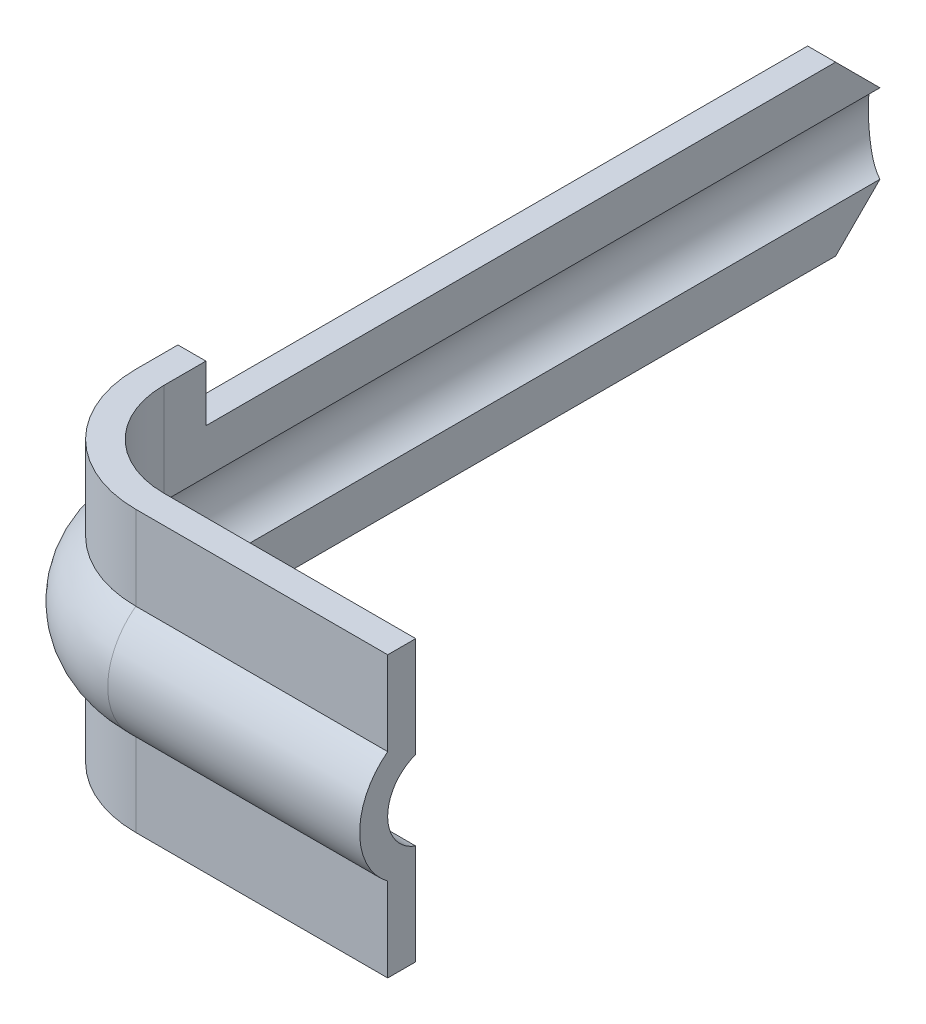
ISO-10303-21;
HEADER;
FILE_DESCRIPTION(('STEP AP214'),'2;1');
FILE_NAME('part.step','',(''),(''),'','','');
FILE_SCHEMA(('AUTOMOTIVE_DESIGN { 1 0 10303 214 1 1 1 1 }'));
ENDSEC;
DATA;
#1=APPLICATION_CONTEXT('core data for automotive mechanical design processes');
#2=APPLICATION_PROTOCOL_DEFINITION('international standard','automotive_design',2000,#1);
#3=PRODUCT_CONTEXT('',#1,'mechanical');
#4=PRODUCT('Part','Part','',(#3));
#5=PRODUCT_RELATED_PRODUCT_CATEGORY('part','',(#4));
#6=PRODUCT_DEFINITION_FORMATION('','',#4);
#7=PRODUCT_DEFINITION_CONTEXT('part definition',#1,'design');
#8=PRODUCT_DEFINITION('design','',#6,#7);
#9=PRODUCT_DEFINITION_SHAPE('','',#8);
#10=(LENGTH_UNIT() NAMED_UNIT(*) SI_UNIT(.MILLI.,.METRE.));
#11=(NAMED_UNIT(*) PLANE_ANGLE_UNIT() SI_UNIT($,.RADIAN.));
#12=(NAMED_UNIT(*) SI_UNIT($,.STERADIAN.) SOLID_ANGLE_UNIT());
#13=UNCERTAINTY_MEASURE_WITH_UNIT(LENGTH_MEASURE(1.E-05),#10,'distance_accuracy_value','');
#14=(GEOMETRIC_REPRESENTATION_CONTEXT(3) GLOBAL_UNCERTAINTY_ASSIGNED_CONTEXT((#13)) GLOBAL_UNIT_ASSIGNED_CONTEXT((#10,
#11,#12)) REPRESENTATION_CONTEXT('',''));
#15=CARTESIAN_POINT('',(0.,0.,0.));
#16=DIRECTION('',(0.,0.,1.));
#17=DIRECTION('',(1.,0.,0.));
#18=AXIS2_PLACEMENT_3D('',#15,#16,#17);
#19=CARTESIAN_POINT('',(0.65,0.,4.475485135615));
#20=DIRECTION('',(1.,0.,0.));
#21=DIRECTION('',(0.,0.,-1.));
#22=AXIS2_PLACEMENT_3D('',#19,#20,#21);
#23=CYLINDRICAL_SURFACE('',#22,0.375);
#24=DIRECTION('',(1.,0.,0.));
#25=VECTOR('',#24,1.);
#26=CARTESIAN_POINT('',(0.65,-0.300363239545,4.7));
#27=LINE('',#26,#25);
#28=CARTESIAN_POINT('',(2.,-0.300363239545206,4.7));
#29=VERTEX_POINT('',#28);
#30=CARTESIAN_POINT('',(0.65,-0.300363239545066,4.70000000000005));
#31=VERTEX_POINT('',#30);
#32=EDGE_CURVE('E157',#29,#31,#27,.F.);
#33=ORIENTED_EDGE('',*,*,#32,.F.);
#34=CARTESIAN_POINT('',(2.,0.,4.475485135615));
#35=DIRECTION('',(1.,0.,0.));
#36=DIRECTION('',(0.,0.,-1.));
#37=AXIS2_PLACEMENT_3D('',#34,#35,#36);
#38=CIRCLE('',#37,0.375);
#39=CARTESIAN_POINT('',(2.,0.300363239545158,4.7));
#40=VERTEX_POINT('',#39);
#41=EDGE_CURVE('E21',#29,#40,#38,.F.);
#42=ORIENTED_EDGE('',*,*,#41,.T.);
#43=DIRECTION('',(1.,0.,0.));
#44=VECTOR('',#43,1.);
#45=CARTESIAN_POINT('',(0.65,0.300363239545,4.7));
#46=LINE('',#45,#44);
#47=CARTESIAN_POINT('',(0.65,0.300363239545051,4.70000000000004));
#48=VERTEX_POINT('',#47);
#49=EDGE_CURVE('E154',#48,#40,#46,.T.);
#50=ORIENTED_EDGE('',*,*,#49,.F.);
#51=CARTESIAN_POINT('',(0.65,0.,4.475485135615));
#52=DIRECTION('',(1.,0.,0.));
#53=DIRECTION('',(0.,0.,-1.));
#54=AXIS2_PLACEMENT_3D('',#51,#52,#53);
#55=CIRCLE('',#54,0.375);
#56=EDGE_CURVE('E130',#48,#31,#55,.T.);
#57=ORIENTED_EDGE('',*,*,#56,.T.);
#58=EDGE_LOOP('',(#33,#42,#50,#57));
#59=FACE_BOUND('',#58,.T.);
#60=ADVANCED_FACE('F17',(#59),#23,.T.);
#61=CARTESIAN_POINT('',(0.65,0.,4.475485135615));
#62=DIRECTION('',(1.,0.,0.));
#63=DIRECTION('',(0.,0.,-1.));
#64=AXIS2_PLACEMENT_3D('',#61,#62,#63);
#65=CYLINDRICAL_SURFACE('',#64,0.225);
#66=DIRECTION('',(-1.,0.,0.));
#67=VECTOR('',#66,1.);
#68=CARTESIAN_POINT('',(0.65,-0.21230293351,4.549999996033));
#69=LINE('',#68,#67);
#70=CARTESIAN_POINT('',(0.65,-0.212302933509939,4.54999999603298));
#71=VERTEX_POINT('',#70);
#72=CARTESIAN_POINT('',(2.,-0.212302933509947,4.549999996033));
#73=VERTEX_POINT('',#72);
#74=EDGE_CURVE('E122',#71,#73,#69,.F.);
#75=ORIENTED_EDGE('',*,*,#74,.F.);
#76=CARTESIAN_POINT('',(0.65,0.,4.47548513561563));
#77=DIRECTION('',(-1.,0.,0.));
#78=DIRECTION('',(0.,0.,1.));
#79=AXIS2_PLACEMENT_3D('',#76,#77,#78);
#80=CIRCLE('',#79,0.224999999999631);
#81=CARTESIAN_POINT('',(0.65,0.21230293211697,4.54999999999989));
#82=VERTEX_POINT('',#81);
#83=EDGE_CURVE('E197',#71,#82,#80,.T.);
#84=ORIENTED_EDGE('',*,*,#83,.T.);
#85=DIRECTION('',(-1.,0.,0.));
#86=VECTOR('',#85,1.);
#87=CARTESIAN_POINT('',(0.65,0.212302932117,4.55));
#88=LINE('',#87,#86);
#89=CARTESIAN_POINT('',(2.,0.212302932117223,4.55));
#90=VERTEX_POINT('',#89);
#91=EDGE_CURVE('E194',#90,#82,#88,.T.);
#92=ORIENTED_EDGE('',*,*,#91,.F.);
#93=CARTESIAN_POINT('',(2.,0.,4.475485135615));
#94=DIRECTION('',(1.,0.,0.));
#95=DIRECTION('',(0.,0.,-1.));
#96=AXIS2_PLACEMENT_3D('',#93,#94,#95);
#97=CIRCLE('',#96,0.225);
#98=EDGE_CURVE('E199',#73,#90,#97,.F.);
#99=ORIENTED_EDGE('',*,*,#98,.F.);
#100=EDGE_LOOP('',(#75,#84,#92,#99));
#101=FACE_BOUND('',#100,.T.);
#102=ADVANCED_FACE('F487',(#101),#65,.F.);
#103=CARTESIAN_POINT('',(0.65,0.,4.05));
#104=DIRECTION('',(0.,1.,0.));
#105=DIRECTION('',(0.,0.,1.));
#106=AXIS2_PLACEMENT_3D('',#103,#104,#105);
#107=TOROIDAL_SURFACE('',#106,0.425485135615343,0.224999999999753);
#108=CARTESIAN_POINT('',(0.65,-0.21230293351,4.05));
#109=DIRECTION('',(0.,1.,0.));
#110=DIRECTION('',(0.,0.,1.));
#111=AXIS2_PLACEMENT_3D('',#108,#109,#110);
#112=CIRCLE('',#111,0.499999996033);
#113=CARTESIAN_POINT('',(0.15000000260008,-0.212302934478904,4.05));
#114=VERTEX_POINT('',#113);
#115=EDGE_CURVE('E182',#71,#114,#112,.F.);
#116=ORIENTED_EDGE('',*,*,#115,.T.);
#117=CARTESIAN_POINT('',(0.224514864384999,0.,4.05));
#118=DIRECTION('',(0.,0.,1.));
#119=DIRECTION('',(1.,0.,0.));
#120=AXIS2_PLACEMENT_3D('',#117,#118,#119);
#121=CIRCLE('',#120,0.225);
#122=CARTESIAN_POINT('',(0.149999999999682,0.212302932117223,4.05));
#123=VERTEX_POINT('',#122);
#124=EDGE_CURVE('E186',#114,#123,#121,.F.);
#125=ORIENTED_EDGE('',*,*,#124,.T.);
#126=CARTESIAN_POINT('',(0.65,0.212302932117,4.05));
#127=DIRECTION('',(0.,1.,0.));
#128=DIRECTION('',(0.,0.,1.));
#129=AXIS2_PLACEMENT_3D('',#126,#127,#128);
#130=CIRCLE('',#129,0.5);
#131=EDGE_CURVE('E165',#123,#82,#130,.T.);
#132=ORIENTED_EDGE('',*,*,#131,.T.);
#133=ORIENTED_EDGE('',*,*,#83,.F.);
#134=EDGE_LOOP('',(#116,#125,#132,#133));
#135=FACE_BOUND('',#134,.T.);
#136=ADVANCED_FACE('F485',(#135),#107,.F.);
#137=CARTESIAN_POINT('',(0.65,0.212302932117,4.55));
#138=DIRECTION('',(0.,0.,-1.));
#139=DIRECTION('',(-1.,0.,0.));
#140=AXIS2_PLACEMENT_3D('',#137,#138,#139);
#141=PLANE('',#140);
#142=DIRECTION('',(1.,0.,0.));
#143=VECTOR('',#142,1.);
#144=CARTESIAN_POINT('',(0.15,0.75,4.55));
#145=LINE('',#144,#143);
#146=CARTESIAN_POINT('',(2.,0.75,4.55));
#147=VERTEX_POINT('',#146);
#148=CARTESIAN_POINT('',(0.65,0.75,4.55));
#149=VERTEX_POINT('',#148);
#150=EDGE_CURVE('E360',#147,#149,#145,.F.);
#151=ORIENTED_EDGE('',*,*,#150,.F.);
#152=DIRECTION('',(0.,1.,0.));
#153=VECTOR('',#152,1.);
#154=CARTESIAN_POINT('',(2.,0.,4.55));
#155=LINE('',#154,#153);
#156=EDGE_CURVE('E389',#147,#90,#155,.F.);
#157=ORIENTED_EDGE('',*,*,#156,.T.);
#158=ORIENTED_EDGE('',*,*,#91,.T.);
#159=DIRECTION('',(0.,1.,0.));
#160=VECTOR('',#159,1.);
#161=CARTESIAN_POINT('',(0.65,0.,4.55));
#162=LINE('',#161,#160);
#163=EDGE_CURVE('E163',#82,#149,#162,.T.);
#164=ORIENTED_EDGE('',*,*,#163,.T.);
#165=EDGE_LOOP('',(#151,#157,#158,#164));
#166=FACE_BOUND('',#165,.T.);
#167=ADVANCED_FACE('F481',(#166),#141,.T.);
#168=CARTESIAN_POINT('',(0.65,0.,4.05));
#169=DIRECTION('',(0.,1.,0.));
#170=DIRECTION('',(0.,0.,1.));
#171=AXIS2_PLACEMENT_3D('',#168,#169,#170);
#172=CYLINDRICAL_SURFACE('',#171,0.5);
#173=ORIENTED_EDGE('',*,*,#131,.F.);
#174=DIRECTION('',(0.,1.,0.));
#175=VECTOR('',#174,1.);
#176=CARTESIAN_POINT('',(0.149999999999999,0.212302932117,4.05));
#177=LINE('',#176,#175);
#178=CARTESIAN_POINT('',(0.15,0.75,4.05));
#179=VERTEX_POINT('',#178);
#180=EDGE_CURVE('E179',#179,#123,#177,.F.);
#181=ORIENTED_EDGE('',*,*,#180,.F.);
#182=CARTESIAN_POINT('',(0.65,0.75,4.05));
#183=DIRECTION('',(0.,1.,0.));
#184=DIRECTION('',(0.,0.,1.));
#185=AXIS2_PLACEMENT_3D('',#182,#183,#184);
#186=CIRCLE('',#185,0.5);
#187=EDGE_CURVE('E357',#149,#179,#186,.F.);
#188=ORIENTED_EDGE('',*,*,#187,.F.);
#189=ORIENTED_EDGE('',*,*,#163,.F.);
#190=EDGE_LOOP('',(#173,#181,#188,#189));
#191=FACE_BOUND('',#190,.T.);
#192=ADVANCED_FACE('F478',(#191),#172,.F.);
#193=CARTESIAN_POINT('',(0.65,0.75,4.7));
#194=DIRECTION('',(0.,0.,1.));
#195=DIRECTION('',(1.,0.,0.));
#196=AXIS2_PLACEMENT_3D('',#193,#194,#195);
#197=PLANE('',#196);
#198=ORIENTED_EDGE('',*,*,#49,.T.);
#199=DIRECTION('',(0.,1.,0.));
#200=VECTOR('',#199,1.);
#201=CARTESIAN_POINT('',(2.,0.,4.7));
#202=LINE('',#201,#200);
#203=CARTESIAN_POINT('',(2.,0.75,4.7));
#204=VERTEX_POINT('',#203);
#205=EDGE_CURVE('E392',#40,#204,#202,.T.);
#206=ORIENTED_EDGE('',*,*,#205,.T.);
#207=DIRECTION('',(1.,0.,0.));
#208=VECTOR('',#207,1.);
#209=CARTESIAN_POINT('',(0.15,0.75,4.7));
#210=LINE('',#209,#208);
#211=CARTESIAN_POINT('',(0.65,0.75,4.7));
#212=VERTEX_POINT('',#211);
#213=EDGE_CURVE('E161',#212,#204,#210,.T.);
#214=ORIENTED_EDGE('',*,*,#213,.F.);
#215=DIRECTION('',(0.,1.,0.));
#216=VECTOR('',#215,1.);
#217=CARTESIAN_POINT('',(0.65,0.75,4.7));
#218=LINE('',#217,#216);
#219=EDGE_CURVE('E148',#212,#48,#218,.F.);
#220=ORIENTED_EDGE('',*,*,#219,.T.);
#221=EDGE_LOOP('',(#198,#206,#214,#220));
#222=FACE_BOUND('',#221,.T.);
#223=ADVANCED_FACE('F159',(#222),#197,.T.);
#224=CARTESIAN_POINT('',(0.65,-0.300363239545,4.7));
#225=DIRECTION('',(0.,0.,1.));
#226=DIRECTION('',(1.,0.,0.));
#227=AXIS2_PLACEMENT_3D('',#224,#225,#226);
#228=PLANE('',#227);
#229=DIRECTION('',(1.,0.,0.));
#230=VECTOR('',#229,1.);
#231=CARTESIAN_POINT('',(0.,-0.75,4.7));
#232=LINE('',#231,#230);
#233=CARTESIAN_POINT('',(2.,-0.75,4.7));
#234=VERTEX_POINT('',#233);
#235=CARTESIAN_POINT('',(0.65,-0.75,4.7));
#236=VERTEX_POINT('',#235);
#237=EDGE_CURVE('E176',#234,#236,#232,.F.);
#238=ORIENTED_EDGE('',*,*,#237,.F.);
#239=DIRECTION('',(0.,1.,0.));
#240=VECTOR('',#239,1.);
#241=CARTESIAN_POINT('',(2.,0.,4.7));
#242=LINE('',#241,#240);
#243=EDGE_CURVE('E396',#234,#29,#242,.T.);
#244=ORIENTED_EDGE('',*,*,#243,.T.);
#245=ORIENTED_EDGE('',*,*,#32,.T.);
#246=DIRECTION('',(0.,1.,0.));
#247=VECTOR('',#246,1.);
#248=CARTESIAN_POINT('',(0.65,-0.300363239545,4.7));
#249=LINE('',#248,#247);
#250=EDGE_CURVE('E204',#31,#236,#249,.F.);
#251=ORIENTED_EDGE('',*,*,#250,.T.);
#252=EDGE_LOOP('',(#238,#244,#245,#251));
#253=FACE_BOUND('',#252,.T.);
#254=ADVANCED_FACE('F420',(#253),#228,.T.);
#255=CARTESIAN_POINT('',(0.65,-0.75,4.549999996033));
#256=DIRECTION('',(0.,0.,-1.));
#257=DIRECTION('',(-1.,0.,0.));
#258=AXIS2_PLACEMENT_3D('',#255,#256,#257);
#259=PLANE('',#258);
#260=DIRECTION('',(0.,1.,0.));
#261=VECTOR('',#260,1.);
#262=CARTESIAN_POINT('',(2.,0.,4.549999996033));
#263=LINE('',#262,#261);
#264=CARTESIAN_POINT('',(2.,-0.75,4.549999996033));
#265=VERTEX_POINT('',#264);
#266=EDGE_CURVE('E203',#73,#265,#263,.F.);
#267=ORIENTED_EDGE('',*,*,#266,.T.);
#268=DIRECTION('',(1.,0.,0.));
#269=VECTOR('',#268,1.);
#270=CARTESIAN_POINT('',(0.,-0.75,4.549999996033));
#271=LINE('',#270,#269);
#272=CARTESIAN_POINT('',(0.65,-0.75,4.549999996033));
#273=VERTEX_POINT('',#272);
#274=EDGE_CURVE('E330',#273,#265,#271,.T.);
#275=ORIENTED_EDGE('',*,*,#274,.F.);
#276=DIRECTION('',(0.,1.,0.));
#277=VECTOR('',#276,1.);
#278=CARTESIAN_POINT('',(0.65,0.,4.549999996033));
#279=LINE('',#278,#277);
#280=EDGE_CURVE('E188',#273,#71,#279,.T.);
#281=ORIENTED_EDGE('',*,*,#280,.T.);
#282=ORIENTED_EDGE('',*,*,#74,.T.);
#283=EDGE_LOOP('',(#267,#275,#281,#282));
#284=FACE_BOUND('',#283,.T.);
#285=ADVANCED_FACE('F470',(#284),#259,.T.);
#286=CARTESIAN_POINT('',(2.,0.,4.475485135615));
#287=DIRECTION('',(-1.,0.,0.));
#288=DIRECTION('',(0.,0.,1.));
#289=AXIS2_PLACEMENT_3D('',#286,#287,#288);
#290=PLANE('',#289);
#291=DIRECTION('',(0.,0.,1.));
#292=VECTOR('',#291,1.);
#293=CARTESIAN_POINT('',(2.,0.75,0.));
#294=LINE('',#293,#292);
#295=EDGE_CURVE('E173',#204,#147,#294,.F.);
#296=ORIENTED_EDGE('',*,*,#295,.F.);
#297=ORIENTED_EDGE('',*,*,#205,.F.);
#298=ORIENTED_EDGE('',*,*,#41,.F.);
#299=ORIENTED_EDGE('',*,*,#243,.F.);
#300=DIRECTION('',(0.,0.,-1.));
#301=VECTOR('',#300,1.);
#302=CARTESIAN_POINT('',(2.,-0.75,0.));
#303=LINE('',#302,#301);
#304=EDGE_CURVE('E333',#265,#234,#303,.F.);
#305=ORIENTED_EDGE('',*,*,#304,.F.);
#306=ORIENTED_EDGE('',*,*,#266,.F.);
#307=ORIENTED_EDGE('',*,*,#98,.T.);
#308=ORIENTED_EDGE('',*,*,#156,.F.);
#309=EDGE_LOOP('',(#296,#297,#298,#299,#305,#306,#307,#308));
#310=FACE_BOUND('',#309,.T.);
#311=ADVANCED_FACE('F465',(#310),#290,.F.);
#312=CARTESIAN_POINT('',(0.224514864385,0.,0.));
#313=DIRECTION('',(0.,0.,1.));
#314=DIRECTION('',(1.,0.,0.));
#315=AXIS2_PLACEMENT_3D('',#312,#313,#314);
#316=CYLINDRICAL_SURFACE('',#315,0.225);
#317=ORIENTED_EDGE('',*,*,#124,.F.);
#318=DIRECTION('',(0.,0.,1.));
#319=VECTOR('',#318,1.);
#320=CARTESIAN_POINT('',(0.15000000123301,-0.212302935447808,0.212217486093047));
#321=LINE('',#320,#319);
#322=CARTESIAN_POINT('',(0.149878706829823,-0.212217516437203,0.212217486093047));
#323=VERTEX_POINT('',#322);
#324=EDGE_CURVE('E376',#323,#114,#321,.T.);
#325=ORIENTED_EDGE('',*,*,#324,.F.);
#326=CARTESIAN_POINT('',(0.149854531057934,0.212251818902621,0.212251886558882));
#327=CARTESIAN_POINT('',(0.137009872833372,0.207705948526972,0.207680473895742));
#328=CARTESIAN_POINT('',(0.124839235359186,0.20214062642089,0.202417834791372));
#329=CARTESIAN_POINT('',(0.101858196558429,0.189098899184247,0.191212930079771));
#330=CARTESIAN_POINT('',(0.091051332454233,0.181617670906104,0.185268970473873));
#331=CARTESIAN_POINT('',(0.0709116779501815,0.164926276219742,0.173455854395994));
#332=CARTESIAN_POINT('',(0.0615737792867725,0.155722356485768,0.167586507013828));
#333=CARTESIAN_POINT('',(0.0445066488330214,0.135629283834086,0.156428309511392));
#334=CARTESIAN_POINT('',(0.0367748848776444,0.124742831525081,0.15113855195332));
#335=CARTESIAN_POINT('',(0.0245888606867424,0.103779791506947,0.142606903498528));
#336=CARTESIAN_POINT('',(0.019787953314767,0.0939856996557298,0.13916723484887));
#337=CARTESIAN_POINT('',(0.0115939740804189,0.0735562783870996,0.133227509892223));
#338=CARTESIAN_POINT('',(0.00819979692309745,0.0629216172745249,0.130726716039307));
#339=CARTESIAN_POINT('',(0.00299194705349421,0.0409913393325028,0.126868175821447));
#340=CARTESIAN_POINT('',(0.00118848377505598,0.0296919424761923,0.12551781496205));
#341=CARTESIAN_POINT('',(-0.000670971779712993,0.00687021780712609,0.12412535134443));
#342=CARTESIAN_POINT('',(-0.000727653770083453,-0.00465202021885714,0.124082732226319));
#343=CARTESIAN_POINT('',(0.00082169530769036,-0.0263015087161359,0.125243240037184));
#344=CARTESIAN_POINT('',(0.00225498435335125,-0.0364489499031219,0.12631694598688));
#345=CARTESIAN_POINT('',(0.00643922332999267,-0.0563121889376492,0.129425082353867));
#346=CARTESIAN_POINT('',(0.00919027079931912,-0.0660279547750986,0.131459583887535));
#347=CARTESIAN_POINT('',(0.0159780558423753,-0.0851064544130938,0.13641505698033));
#348=CARTESIAN_POINT('',(0.0200513306223396,-0.0944494816443028,0.139361093364397));
#349=CARTESIAN_POINT('',(0.0292957223225264,-0.112320339203326,0.145920879918083));
#350=CARTESIAN_POINT('',(0.0344674997572095,-0.120847674572672,0.149535031645922));
#351=CARTESIAN_POINT('',(0.046702211971752,-0.138346635000022,0.157864223749857));
#352=CARTESIAN_POINT('',(0.0539364513548188,-0.147158562953652,0.162662482201177));
#353=CARTESIAN_POINT('',(0.0695411380838533,-0.163511365804319,0.172558538969062));
#354=CARTESIAN_POINT('',(0.0779120996840653,-0.171051661932379,0.177656472263404));
#355=CARTESIAN_POINT('',(0.0961703590875287,-0.185184776837844,0.188071793329845));
#356=CARTESIAN_POINT('',(0.106114068995095,-0.191707404838909,0.193386711928983));
#357=CARTESIAN_POINT('',(0.127138437883396,-0.203185226595241,0.203411628211903));
#358=CARTESIAN_POINT('',(0.138219139192974,-0.208140361966553,0.208121603359648));
#359=CARTESIAN_POINT('',(0.149854533802602,-0.212251819868164,0.212251887567013));
#360=B_SPLINE_CURVE_WITH_KNOTS('',3,(#326,#327,#328,#329,#330,#331,#332,#333,#334,#335,#336,
#337,#338,#339,#340,#341,#342,#343,#344,#345,#346,#347,#348,#349,#350,#351,#352,#353,#354,#355,
#356,#357,#358,#359),.UNSPECIFIED.,.F.,.F.,(4,2,2,2,2,2,2,2,2,2,2,2,2,2,2,2,4),(0.,
0.0429654000817238,0.0860400441416619,0.128961418834472,0.171814603128912,0.205989054978089,
0.240136604164766,0.27450175515878,0.308853336949201,0.339623345820457,0.370395632589994,
0.4021032492694,0.433829985546777,0.47080297466866,0.507792746481156,0.546717356360889,
0.585643415883894),.UNSPECIFIED.);
#361=CARTESIAN_POINT('',(0.149878703882219,0.212217513609271,0.212217487525755));
#362=VERTEX_POINT('',#361);
#363=EDGE_CURVE('E189',#362,#323,#360,.T.);
#364=ORIENTED_EDGE('',*,*,#363,.F.);
#365=DIRECTION('',(0.,0.,1.));
#366=VECTOR('',#365,1.);
#367=CARTESIAN_POINT('',(0.149999999999999,0.212302932117445,4.05));
#368=LINE('',#367,#366);
#369=EDGE_CURVE('E181',#123,#362,#368,.F.);
#370=ORIENTED_EDGE('',*,*,#369,.F.);
#371=EDGE_LOOP('',(#317,#325,#364,#370));
#372=FACE_BOUND('',#371,.T.);
#373=ADVANCED_FACE('F459',(#372),#316,.F.);
#374=CARTESIAN_POINT('',(0.65,0.,4.05));
#375=DIRECTION('',(0.,1.,0.));
#376=DIRECTION('',(0.,0.,1.));
#377=AXIS2_PLACEMENT_3D('',#374,#375,#376);
#378=CYLINDRICAL_SURFACE('',#377,0.499999996033);
#379=DIRECTION('',(0.,1.,0.));
#380=VECTOR('',#379,1.);
#381=CARTESIAN_POINT('',(0.150000003966999,-0.75,4.05));
#382=LINE('',#381,#380);
#383=CARTESIAN_POINT('',(0.150000003966999,-0.75,4.05));
#384=VERTEX_POINT('',#383);
#385=EDGE_CURVE('E316',#114,#384,#382,.F.);
#386=ORIENTED_EDGE('',*,*,#385,.F.);
#387=ORIENTED_EDGE('',*,*,#115,.F.);
#388=ORIENTED_EDGE('',*,*,#280,.F.);
#389=CARTESIAN_POINT('',(0.65,-0.75,4.05));
#390=DIRECTION('',(0.,1.,0.));
#391=DIRECTION('',(0.,0.,1.));
#392=AXIS2_PLACEMENT_3D('',#389,#390,#391);
#393=CIRCLE('',#392,0.499999996033);
#394=EDGE_CURVE('E334',#384,#273,#393,.T.);
#395=ORIENTED_EDGE('',*,*,#394,.F.);
#396=EDGE_LOOP('',(#386,#387,#388,#395));
#397=FACE_BOUND('',#396,.T.);
#398=ADVANCED_FACE('F464',(#397),#378,.F.);
#399=CARTESIAN_POINT('',(0.15,0.212302932117,0.));
#400=DIRECTION('',(1.,0.,0.));
#401=DIRECTION('',(0.,0.,-1.));
#402=AXIS2_PLACEMENT_3D('',#399,#400,#401);
#403=PLANE('',#402);
#404=DIRECTION('',(0.,0.,1.));
#405=VECTOR('',#404,1.);
#406=CARTESIAN_POINT('',(0.149999999848,0.450000000021,3.824264358675));
#407=LINE('',#406,#405);
#408=CARTESIAN_POINT('',(0.149999999898667,0.450000000021,3.824264358675));
#409=VERTEX_POINT('',#408);
#410=CARTESIAN_POINT('',(0.149999999924,0.450000000021,0.45));
#411=VERTEX_POINT('',#410);
#412=EDGE_CURVE('E300',#409,#411,#407,.F.);
#413=ORIENTED_EDGE('',*,*,#412,.F.);
#414=DIRECTION('',(0.,1.,0.));
#415=VECTOR('',#414,1.);
#416=CARTESIAN_POINT('',(0.15,1.074371982483,3.824264358675));
#417=LINE('',#416,#415);
#418=CARTESIAN_POINT('',(0.15,0.75,3.824264358675));
#419=VERTEX_POINT('',#418);
#420=EDGE_CURVE('E306',#419,#409,#417,.F.);
#421=ORIENTED_EDGE('',*,*,#420,.F.);
#422=DIRECTION('',(0.,0.,1.));
#423=VECTOR('',#422,1.);
#424=CARTESIAN_POINT('',(0.15,0.75,0.));
#425=LINE('',#424,#423);
#426=EDGE_CURVE('E352',#179,#419,#425,.F.);
#427=ORIENTED_EDGE('',*,*,#426,.F.);
#428=ORIENTED_EDGE('',*,*,#180,.T.);
#429=ORIENTED_EDGE('',*,*,#369,.T.);
#430=DIRECTION('',(0.,0.707106781186547,0.707106781186548));
#431=VECTOR('',#430,1.);
#432=CARTESIAN_POINT('',(0.15,0.212217483247,0.212217483226));
#433=LINE('',#432,#431);
#434=EDGE_CURVE('E363',#362,#411,#433,.T.);
#435=ORIENTED_EDGE('',*,*,#434,.T.);
#436=EDGE_LOOP('',(#413,#421,#427,#428,#429,#435));
#437=FACE_BOUND('',#436,.T.);
#438=ADVANCED_FACE('F585',(#437),#403,.T.);
#439=CARTESIAN_POINT('',(0.15,0.75,0.));
#440=DIRECTION('',(0.,1.,0.));
#441=DIRECTION('',(0.,0.,1.));
#442=AXIS2_PLACEMENT_3D('',#439,#440,#441);
#443=PLANE('',#442);
#444=ORIENTED_EDGE('',*,*,#213,.T.);
#445=ORIENTED_EDGE('',*,*,#295,.T.);
#446=ORIENTED_EDGE('',*,*,#150,.T.);
#447=ORIENTED_EDGE('',*,*,#187,.T.);
#448=ORIENTED_EDGE('',*,*,#426,.T.);
#449=DIRECTION('',(-1.,0.,0.));
#450=VECTOR('',#449,1.);
#451=CARTESIAN_POINT('',(0.149999999772,0.75,3.824264358675));
#452=LINE('',#451,#450);
#453=CARTESIAN_POINT('',(0.,0.75,3.824264358675));
#454=VERTEX_POINT('',#453);
#455=EDGE_CURVE('E313',#454,#419,#452,.F.);
#456=ORIENTED_EDGE('',*,*,#455,.F.);
#457=DIRECTION('',(0.,0.,1.));
#458=VECTOR('',#457,1.);
#459=CARTESIAN_POINT('',(0.,0.75,0.));
#460=LINE('',#459,#458);
#461=CARTESIAN_POINT('',(0.,0.75,4.05));
#462=VERTEX_POINT('',#461);
#463=EDGE_CURVE('E348',#454,#462,#460,.T.);
#464=ORIENTED_EDGE('',*,*,#463,.T.);
#465=CARTESIAN_POINT('',(0.65,0.75,4.05));
#466=DIRECTION('',(0.,1.,0.));
#467=DIRECTION('',(0.,0.,1.));
#468=AXIS2_PLACEMENT_3D('',#465,#466,#467);
#469=CIRCLE('',#468,0.65);
#470=EDGE_CURVE('E299',#212,#462,#469,.F.);
#471=ORIENTED_EDGE('',*,*,#470,.F.);
#472=EDGE_LOOP('',(#444,#445,#446,#447,#448,#456,#464,#471));
#473=FACE_BOUND('',#472,.T.);
#474=ADVANCED_FACE('F545',(#473),#443,.T.);
#475=CARTESIAN_POINT('',(0.,-0.75,0.));
#476=DIRECTION('',(0.,-1.,0.));
#477=DIRECTION('',(0.,0.,-1.));
#478=AXIS2_PLACEMENT_3D('',#475,#476,#477);
#479=PLANE('',#478);
#480=ORIENTED_EDGE('',*,*,#274,.T.);
#481=ORIENTED_EDGE('',*,*,#304,.T.);
#482=ORIENTED_EDGE('',*,*,#237,.T.);
#483=CARTESIAN_POINT('',(0.65,-0.75,4.05));
#484=DIRECTION('',(0.,1.,0.));
#485=DIRECTION('',(0.,0.,1.));
#486=AXIS2_PLACEMENT_3D('',#483,#484,#485);
#487=CIRCLE('',#486,0.65);
#488=CARTESIAN_POINT('',(0.,-0.75,4.05));
#489=VERTEX_POINT('',#488);
#490=EDGE_CURVE('E289',#489,#236,#487,.T.);
#491=ORIENTED_EDGE('',*,*,#490,.F.);
#492=DIRECTION('',(0.,0.,-1.));
#493=VECTOR('',#492,1.);
#494=CARTESIAN_POINT('',(0.,-0.75,0.));
#495=LINE('',#494,#493);
#496=CARTESIAN_POINT('',(0.,-0.75,3.824264358675));
#497=VERTEX_POINT('',#496);
#498=EDGE_CURVE('E337',#489,#497,#495,.T.);
#499=ORIENTED_EDGE('',*,*,#498,.T.);
#500=DIRECTION('',(1.,0.,0.));
#501=VECTOR('',#500,1.);
#502=CARTESIAN_POINT('',(0.,-0.75,3.824264358675));
#503=LINE('',#502,#501);
#504=CARTESIAN_POINT('',(0.150000003924666,-0.75,3.824264358675));
#505=VERTEX_POINT('',#504);
#506=EDGE_CURVE('E340',#497,#505,#503,.T.);
#507=ORIENTED_EDGE('',*,*,#506,.T.);
#508=DIRECTION('',(0.,0.,-1.));
#509=VECTOR('',#508,1.);
#510=CARTESIAN_POINT('',(0.150000003967,-0.75,0.));
#511=LINE('',#510,#509);
#512=EDGE_CURVE('E323',#384,#505,#511,.T.);
#513=ORIENTED_EDGE('',*,*,#512,.F.);
#514=ORIENTED_EDGE('',*,*,#394,.T.);
#515=EDGE_LOOP('',(#480,#481,#482,#491,#499,#507,#513,#514));
#516=FACE_BOUND('',#515,.T.);
#517=ADVANCED_FACE('F426',(#516),#479,.T.);
#518=CARTESIAN_POINT('',(0.150000003967,-0.75,0.));
#519=DIRECTION('',(1.,0.,0.));
#520=DIRECTION('',(0.,0.,-1.));
#521=AXIS2_PLACEMENT_3D('',#518,#519,#520);
#522=PLANE('',#521);
#523=ORIENTED_EDGE('',*,*,#324,.T.);
#524=ORIENTED_EDGE('',*,*,#385,.T.);
#525=ORIENTED_EDGE('',*,*,#512,.T.);
#526=DIRECTION('',(0.,1.,0.));
#527=VECTOR('',#526,1.);
#528=CARTESIAN_POINT('',(0.150000003966999,-0.75,3.824264358675));
#529=LINE('',#528,#527);
#530=CARTESIAN_POINT('',(0.150000003916333,-0.449999999979,3.824264358675));
#531=VERTEX_POINT('',#530);
#532=EDGE_CURVE('E319',#505,#531,#529,.T.);
#533=ORIENTED_EDGE('',*,*,#532,.T.);
#534=DIRECTION('',(0.,0.,-1.));
#535=VECTOR('',#534,1.);
#536=CARTESIAN_POINT('',(0.150000003891,-0.449999999979,0.));
#537=LINE('',#536,#535);
#538=CARTESIAN_POINT('',(0.150000003929,-0.449999999979069,0.449999999999896));
#539=VERTEX_POINT('',#538);
#540=EDGE_CURVE('E286',#539,#531,#537,.F.);
#541=ORIENTED_EDGE('',*,*,#540,.F.);
#542=DIRECTION('',(0.,0.70710678118506,-0.707106781188034));
#543=VECTOR('',#542,1.);
#544=CARTESIAN_POINT('',(0.150000003967,-0.449999999979,0.45));
#545=LINE('',#544,#543);
#546=EDGE_CURVE('E322',#539,#323,#545,.T.);
#547=ORIENTED_EDGE('',*,*,#546,.T.);
#548=EDGE_LOOP('',(#523,#524,#525,#533,#541,#547));
#549=FACE_BOUND('',#548,.T.);
#550=ADVANCED_FACE('F515',(#549),#522,.T.);
#551=CARTESIAN_POINT('',(0.149999999772,1.074371982483,3.824264358675));
#552=DIRECTION('',(0.,0.,-1.));
#553=DIRECTION('',(-1.,0.,0.));
#554=AXIS2_PLACEMENT_3D('',#551,#552,#553);
#555=PLANE('',#554);
#556=ORIENTED_EDGE('',*,*,#420,.T.);
#557=DIRECTION('',(1.,0.,0.));
#558=VECTOR('',#557,1.);
#559=CARTESIAN_POINT('',(0.149999999772,0.450000000021,3.824264358675));
#560=LINE('',#559,#558);
#561=CARTESIAN_POINT('',(0.,0.450000000021,3.824264358675));
#562=VERTEX_POINT('',#561);
#563=EDGE_CURVE('E303',#562,#409,#560,.T.);
#564=ORIENTED_EDGE('',*,*,#563,.F.);
#565=DIRECTION('',(0.,-1.,0.));
#566=VECTOR('',#565,1.);
#567=CARTESIAN_POINT('',(0.,0.75,3.824264358675));
#568=LINE('',#567,#566);
#569=EDGE_CURVE('E152',#454,#562,#568,.T.);
#570=ORIENTED_EDGE('',*,*,#569,.F.);
#571=ORIENTED_EDGE('',*,*,#455,.T.);
#572=EDGE_LOOP('',(#556,#564,#570,#571));
#573=FACE_BOUND('',#572,.T.);
#574=ADVANCED_FACE('F588',(#573),#555,.T.);
#575=CARTESIAN_POINT('',(0.149999999772,0.450000000021,3.824264358675));
#576=DIRECTION('',(0.,1.,0.));
#577=DIRECTION('',(0.,0.,1.));
#578=AXIS2_PLACEMENT_3D('',#575,#576,#577);
#579=PLANE('',#578);
#580=ORIENTED_EDGE('',*,*,#412,.T.);
#581=DIRECTION('',(1.,0.,0.));
#582=VECTOR('',#581,1.);
#583=CARTESIAN_POINT('',(0.149999999772,0.450000000021,0.45));
#584=LINE('',#583,#582);
#585=CARTESIAN_POINT('',(0.,0.450000000021,0.45));
#586=VERTEX_POINT('',#585);
#587=EDGE_CURVE('E296',#411,#586,#584,.F.);
#588=ORIENTED_EDGE('',*,*,#587,.T.);
#589=DIRECTION('',(0.,0.,1.));
#590=VECTOR('',#589,1.);
#591=CARTESIAN_POINT('',(0.,0.450000000021,0.));
#592=LINE('',#591,#590);
#593=EDGE_CURVE('E266',#562,#586,#592,.F.);
#594=ORIENTED_EDGE('',*,*,#593,.F.);
#595=ORIENTED_EDGE('',*,*,#563,.T.);
#596=EDGE_LOOP('',(#580,#588,#594,#595));
#597=FACE_BOUND('',#596,.T.);
#598=ADVANCED_FACE('F593',(#597),#579,.T.);
#599=CARTESIAN_POINT('',(0.65,0.,4.05));
#600=DIRECTION('',(0.,1.,0.));
#601=DIRECTION('',(0.,0.,1.));
#602=AXIS2_PLACEMENT_3D('',#599,#600,#601);
#603=CYLINDRICAL_SURFACE('',#602,0.65);
#604=CARTESIAN_POINT('',(0.65,0.300363239545,4.05));
#605=DIRECTION('',(0.,-1.,0.));
#606=DIRECTION('',(0.,0.,-1.));
#607=AXIS2_PLACEMENT_3D('',#604,#605,#606);
#608=CIRCLE('',#607,0.649999999999999);
#609=CARTESIAN_POINT('',(0.,0.300363239545152,4.05));
#610=VERTEX_POINT('',#609);
#611=EDGE_CURVE('E137',#48,#610,#608,.T.);
#612=ORIENTED_EDGE('',*,*,#611,.F.);
#613=ORIENTED_EDGE('',*,*,#219,.F.);
#614=ORIENTED_EDGE('',*,*,#470,.T.);
#615=DIRECTION('',(0.,-1.,0.));
#616=VECTOR('',#615,1.);
#617=CARTESIAN_POINT('',(0.,0.75,4.05));
#618=LINE('',#617,#616);
#619=EDGE_CURVE('E151',#610,#462,#618,.F.);
#620=ORIENTED_EDGE('',*,*,#619,.F.);
#621=EDGE_LOOP('',(#612,#613,#614,#620));
#622=FACE_BOUND('',#621,.T.);
#623=ADVANCED_FACE('F145',(#622),#603,.T.);
#624=CARTESIAN_POINT('',(0.65,0.,4.05));
#625=DIRECTION('',(0.,1.,0.));
#626=DIRECTION('',(0.,0.,1.));
#627=AXIS2_PLACEMENT_3D('',#624,#625,#626);
#628=CYLINDRICAL_SURFACE('',#627,0.65);
#629=ORIENTED_EDGE('',*,*,#490,.T.);
#630=ORIENTED_EDGE('',*,*,#250,.F.);
#631=CARTESIAN_POINT('',(0.65,-0.300363239545,4.05));
#632=DIRECTION('',(0.,1.,0.));
#633=DIRECTION('',(0.,0.,1.));
#634=AXIS2_PLACEMENT_3D('',#631,#632,#633);
#635=CIRCLE('',#634,0.649999999999999);
#636=CARTESIAN_POINT('',(0.,-0.300363239545199,4.05));
#637=VERTEX_POINT('',#636);
#638=EDGE_CURVE('E140',#637,#31,#635,.T.);
#639=ORIENTED_EDGE('',*,*,#638,.F.);
#640=DIRECTION('',(0.,-1.,0.));
#641=VECTOR('',#640,1.);
#642=CARTESIAN_POINT('',(0.,-0.300363239545,4.05));
#643=LINE('',#642,#641);
#644=EDGE_CURVE('E431',#489,#637,#643,.F.);
#645=ORIENTED_EDGE('',*,*,#644,.F.);
#646=EDGE_LOOP('',(#629,#630,#639,#645));
#647=FACE_BOUND('',#646,.T.);
#648=ADVANCED_FACE('F429',(#647),#628,.T.);
#649=CARTESIAN_POINT('',(0.150000003739,-0.449999999979,0.));
#650=DIRECTION('',(0.,-1.,0.));
#651=DIRECTION('',(0.,0.,-1.));
#652=AXIS2_PLACEMENT_3D('',#649,#650,#651);
#653=PLANE('',#652);
#654=DIRECTION('',(0.,0.,1.));
#655=VECTOR('',#654,1.);
#656=CARTESIAN_POINT('',(0.,-0.449999999979,0.));
#657=LINE('',#656,#655);
#658=CARTESIAN_POINT('',(0.,-0.449999999979046,0.449999999999954));
#659=VERTEX_POINT('',#658);
#660=CARTESIAN_POINT('',(0.,-0.449999999979,3.824264358675));
#661=VERTEX_POINT('',#660);
#662=EDGE_CURVE('E280',#659,#661,#657,.T.);
#663=ORIENTED_EDGE('',*,*,#662,.F.);
#664=DIRECTION('',(1.,0.,0.));
#665=VECTOR('',#664,1.);
#666=CARTESIAN_POINT('',(0.224514864385,-0.449999999979138,0.449999999999862));
#667=LINE('',#666,#665);
#668=EDGE_CURVE('E260',#659,#539,#667,.T.);
#669=ORIENTED_EDGE('',*,*,#668,.T.);
#670=ORIENTED_EDGE('',*,*,#540,.T.);
#671=DIRECTION('',(-1.,0.,0.));
#672=VECTOR('',#671,1.);
#673=CARTESIAN_POINT('',(0.150000003739,-0.449999999979,3.824264358675));
#674=LINE('',#673,#672);
#675=EDGE_CURVE('E272',#661,#531,#674,.F.);
#676=ORIENTED_EDGE('',*,*,#675,.F.);
#677=EDGE_LOOP('',(#663,#669,#670,#676));
#678=FACE_BOUND('',#677,.T.);
#679=ADVANCED_FACE('F520',(#678),#653,.T.);
#680=CARTESIAN_POINT('',(0.150000003739,-0.449999999979,3.824264358675));
#681=DIRECTION('',(0.,0.,-1.));
#682=DIRECTION('',(-1.,0.,0.));
#683=AXIS2_PLACEMENT_3D('',#680,#681,#682);
#684=PLANE('',#683);
#685=DIRECTION('',(0.,-1.,0.));
#686=VECTOR('',#685,1.);
#687=CARTESIAN_POINT('',(0.,-0.300363239545,3.824264358675));
#688=LINE('',#687,#686);
#689=EDGE_CURVE('E283',#661,#497,#688,.T.);
#690=ORIENTED_EDGE('',*,*,#689,.F.);
#691=ORIENTED_EDGE('',*,*,#675,.T.);
#692=ORIENTED_EDGE('',*,*,#532,.F.);
#693=ORIENTED_EDGE('',*,*,#506,.F.);
#694=EDGE_LOOP('',(#690,#691,#692,#693));
#695=FACE_BOUND('',#694,.T.);
#696=ADVANCED_FACE('F570',(#695),#684,.T.);
#697=CARTESIAN_POINT('',(0.65,0.,4.05));
#698=DIRECTION('',(0.,1.,0.));
#699=DIRECTION('',(0.,0.,1.));
#700=AXIS2_PLACEMENT_3D('',#697,#698,#699);
#701=TOROIDAL_SURFACE('',#700,0.425485135615811,0.374999999999225);
#702=ORIENTED_EDGE('',*,*,#56,.F.);
#703=ORIENTED_EDGE('',*,*,#611,.T.);
#704=CARTESIAN_POINT('',(0.224514864384999,0.,4.05));
#705=DIRECTION('',(0.,0.,1.));
#706=DIRECTION('',(1.,0.,0.));
#707=AXIS2_PLACEMENT_3D('',#704,#705,#706);
#708=CIRCLE('',#707,0.375);
#709=EDGE_CURVE('E416',#637,#610,#708,.F.);
#710=ORIENTED_EDGE('',*,*,#709,.F.);
#711=ORIENTED_EDGE('',*,*,#638,.T.);
#712=EDGE_LOOP('',(#702,#703,#710,#711));
#713=FACE_BOUND('',#712,.T.);
#714=ADVANCED_FACE('F19',(#713),#701,.T.);
#715=CARTESIAN_POINT('',(0.,0.75,0.));
#716=DIRECTION('',(-1.,0.,0.));
#717=DIRECTION('',(0.,-1.,0.));
#718=AXIS2_PLACEMENT_3D('',#715,#716,#717);
#719=PLANE('',#718);
#720=DIRECTION('',(0.,0.,1.));
#721=VECTOR('',#720,1.);
#722=CARTESIAN_POINT('',(-1.49592794748687E-13,0.300363239545203,0.));
#723=LINE('',#722,#721);
#724=CARTESIAN_POINT('',(0.,0.300363239545259,0.300363239524259));
#725=VERTEX_POINT('',#724);
#726=EDGE_CURVE('E550',#610,#725,#723,.F.);
#727=ORIENTED_EDGE('',*,*,#726,.F.);
#728=ORIENTED_EDGE('',*,*,#619,.T.);
#729=ORIENTED_EDGE('',*,*,#463,.F.);
#730=ORIENTED_EDGE('',*,*,#569,.T.);
#731=ORIENTED_EDGE('',*,*,#593,.T.);
#732=DIRECTION('',(0.,-0.707106781186548,-0.707106781186548));
#733=VECTOR('',#732,1.);
#734=CARTESIAN_POINT('',(0.,0.450000000021,0.45));
#735=LINE('',#734,#733);
#736=EDGE_CURVE('E261',#586,#725,#735,.T.);
#737=ORIENTED_EDGE('',*,*,#736,.T.);
#738=EDGE_LOOP('',(#727,#728,#729,#730,#731,#737));
#739=FACE_BOUND('',#738,.T.);
#740=ADVANCED_FACE('F548',(#739),#719,.T.);
#741=CARTESIAN_POINT('',(0.149999999772,0.450000000021,0.45));
#742=DIRECTION('',(0.,-0.707106781186548,0.707106781186548));
#743=DIRECTION('',(0.,-0.707106781186548,-0.707106781186548));
#744=AXIS2_PLACEMENT_3D('',#741,#742,#743);
#745=PLANE('',#744);
#746=ORIENTED_EDGE('',*,*,#736,.F.);
#747=ORIENTED_EDGE('',*,*,#587,.F.);
#748=ORIENTED_EDGE('',*,*,#434,.F.);
#749=CARTESIAN_POINT('',(-0.08471805752194,0.212132034376827,0.212132034356173));
#750=CARTESIAN_POINT('',(-0.0749482454492758,0.212135594746217,0.212135594725564));
#751=CARTESIAN_POINT('',(-0.0651784333766117,0.212139155025974,0.212139155184589));
#752=CARTESIAN_POINT('',(-0.0456388092312833,0.212146275406208,0.2121462762819));
#753=CARTESIAN_POINT('',(-0.0358689971586192,0.212149835506687,0.212149836920185));
#754=CARTESIAN_POINT('',(-0.0163293730132908,0.212156955528356,0.212156958376006));
#755=CARTESIAN_POINT('',(-0.00655956094062667,0.212160515449547,0.212160519193542));
#756=CARTESIAN_POINT('',(0.0129800632047017,0.212167635112634,0.212167641007856));
#757=CARTESIAN_POINT('',(0.0227498752773658,0.212171194854529,0.212171202004634));
#758=CARTESIAN_POINT('',(0.0422894994226942,0.212178314159015,0.212178324177423));
#759=CARTESIAN_POINT('',(0.0520593114953583,0.212181873721605,0.212181885353434));
#760=CARTESIAN_POINT('',(0.0715989356406867,0.212188992667471,0.21218900788468));
#761=CARTESIAN_POINT('',(0.0813687477133508,0.212192552050747,0.212192569239914));
#762=CARTESIAN_POINT('',(0.100908371858679,0.212199670637976,0.212199692129599));
#763=CARTESIAN_POINT('',(0.110678183931343,0.212203229841929,0.212203253664048));
#764=CARTESIAN_POINT('',(0.130217808076672,0.212210348070503,0.212210376912153));
#765=CARTESIAN_POINT('',(0.139987620149336,0.212213907095123,0.212213938625808));
#766=CARTESIAN_POINT('',(0.149757432222,0.212217466030074,0.212217500429062));
#767=B_SPLINE_CURVE_WITH_KNOTS('',3,(#749,#750,#751,#752,#753,#754,#755,#756,#757,#758,#759,
#760,#761,#762,#763,#764,#765,#766),.UNSPECIFIED.,.F.,.F.,(4,2,2,2,2,2,2,2,4),(0.,
0.0293094401104613,0.0586188802209225,0.0879283203313837,0.117237760441845,0.146547200552306,
0.175856640662767,0.205166080773229,0.23447552088369),.UNSPECIFIED.);
#768=CARTESIAN_POINT('',(-0.0847180575219562,0.212132034376832,0.212132034356179));
#769=VERTEX_POINT('',#768);
#770=EDGE_CURVE('E252',#769,#362,#767,.T.);
#771=ORIENTED_EDGE('',*,*,#770,.F.);
#772=CARTESIAN_POINT('',(0.224514864385,0.,-2.1048285377521E-11));
#773=DIRECTION('',(0.,-0.707106781186548,0.707106781186548));
#774=DIRECTION('',(0.,0.707106781186548,0.707106781186548));
#775=AXIS2_PLACEMENT_3D('',#772,#773,#774);
#776=ELLIPSE('',#775,0.530330085889911,0.375);
#777=EDGE_CURVE('E228',#725,#769,#776,.T.);
#778=ORIENTED_EDGE('',*,*,#777,.F.);
#779=EDGE_LOOP('',(#746,#747,#748,#771,#778));
#780=FACE_BOUND('',#779,.T.);
#781=ADVANCED_FACE('F239',(#780),#745,.F.);
#782=CARTESIAN_POINT('',(0.149999999772,2.072482268266E-11,0.424264068712));
#783=DIRECTION('',(-1.,0.,0.));
#784=DIRECTION('',(0.,0.,1.));
#785=AXIS2_PLACEMENT_3D('',#782,#783,#784);
#786=CYLINDRICAL_SURFACE('',#785,0.3);
#787=ORIENTED_EDGE('',*,*,#363,.T.);
#788=DIRECTION('',(-0.999999867191784,0.000364428604170927,-0.000364428604170927));
#789=VECTOR('',#788,1.);
#790=CARTESIAN_POINT('',(0.149757434147,-0.212217483922638,0.212217483943362));
#791=LINE('',#790,#789);
#792=CARTESIAN_POINT('',(-0.0847180575505829,-0.212132034335135,0.212132034355893));
#793=VERTEX_POINT('',#792);
#794=EDGE_CURVE('E277',#323,#793,#791,.T.);
#795=ORIENTED_EDGE('',*,*,#794,.T.);
#796=CARTESIAN_POINT('',(-0.0847180575219724,0.212132034376838,0.212132034356184));
#797=CARTESIAN_POINT('',(-0.0922319983032705,0.201199190962973,0.201199627164675));
#798=CARTESIAN_POINT('',(-0.0995268876093026,0.189299838788098,0.190992372318933));
#799=CARTESIAN_POINT('',(-0.113222164139079,0.163614918001509,0.172302633288068));
#800=CARTESIAN_POINT('',(-0.119615836500971,0.149816563703722,0.163832902332041));
#801=CARTESIAN_POINT('',(-0.130041274967068,0.122841979749177,0.150219662585526));
#802=CARTESIAN_POINT('',(-0.134286365930376,0.109909279982271,0.144762512788332));
#803=CARTESIAN_POINT('',(-0.141422908840188,0.0831020691179752,0.135657692865282));
#804=CARTESIAN_POINT('',(-0.144318316734334,0.0692304486467968,0.132004732726155));
#805=CARTESIAN_POINT('',(-0.148540618025522,0.0407750816780894,0.126693947271327));
#806=CARTESIAN_POINT('',(-0.149857245474178,0.0261873095793976,0.12504917888605));
#807=CARTESIAN_POINT('',(-0.150758619145696,-0.00313336820435057,0.123922025700479));
#808=CARTESIAN_POINT('',(-0.150342778446458,-0.0178663213869522,0.124440373716539));
#809=CARTESIAN_POINT('',(-0.147941569167624,-0.0455646775460028,0.12744854762391));
#810=CARTESIAN_POINT('',(-0.146108742434127,-0.0585652302861428,0.129746802140051));
#811=CARTESIAN_POINT('',(-0.1412011409907,-0.0839267888555746,0.135946860948549));
#812=CARTESIAN_POINT('',(-0.138126353457381,-0.0962877880799153,0.139848681797923));
#813=CARTESIAN_POINT('',(-0.130737799122194,-0.120804067829598,0.149330155850917));
#814=CARTESIAN_POINT('',(-0.126364585019135,-0.132909582919035,0.154991125193717));
#815=CARTESIAN_POINT('',(-0.11672832075277,-0.155995693666251,0.167672256016157));
#816=CARTESIAN_POINT('',(-0.111464706265287,-0.166975568775674,0.174693279892796));
#817=CARTESIAN_POINT('',(-0.0992025116359511,-0.189823844725212,0.191444374387238));
#818=CARTESIAN_POINT('',(-0.0920675211874351,-0.201430394460378,0.201435403081371));
#819=CARTESIAN_POINT('',(-0.0847180575507506,-0.212132034336402,0.212132034354366));
#820=B_SPLINE_CURVE_WITH_KNOTS('',3,(#796,#797,#798,#799,#800,#801,#802,#803,#804,#805,#806,
#807,#808,#809,#810,#811,#812,#813,#814,#815,#816,#817,#818,#819),.UNSPECIFIED.,.F.,.F.,(4,2,2,
2,2,2,2,2,2,2,2,4),(0.,0.0516206501524925,0.103607608400631,0.147417389781763,0.191097943669299,
0.235061014326492,0.279038979915845,0.31884747616596,0.358656383453944,0.400681565814518,
0.4427334836711,0.49320011977548),.UNSPECIFIED.);
#821=EDGE_CURVE('E220',#769,#793,#820,.T.);
#822=ORIENTED_EDGE('',*,*,#821,.F.);
#823=ORIENTED_EDGE('',*,*,#770,.T.);
#824=EDGE_LOOP('',(#787,#795,#822,#823));
#825=FACE_BOUND('',#824,.T.);
#826=ADVANCED_FACE('F233',(#825),#786,.T.);
#827=CARTESIAN_POINT('',(0.224514864385,2.072387400576E-11,0.));
#828=DIRECTION('',(0.,0.707106781186548,0.707106781186548));
#829=DIRECTION('',(0.,-0.707106781186548,0.707106781186548));
#830=AXIS2_PLACEMENT_3D('',#827,#828,#829);
#831=PLANE('',#830);
#832=ORIENTED_EDGE('',*,*,#546,.F.);
#833=ORIENTED_EDGE('',*,*,#668,.F.);
#834=DIRECTION('',(0.,-0.707106781186547,0.707106781186548));
#835=VECTOR('',#834,1.);
#836=CARTESIAN_POINT('',(0.,-0.300363239545,0.300363239566));
#837=LINE('',#836,#835);
#838=CARTESIAN_POINT('',(0.,-0.30036323954527,0.300363239566132));
#839=VERTEX_POINT('',#838);
#840=EDGE_CURVE('E36',#839,#659,#837,.T.);
#841=ORIENTED_EDGE('',*,*,#840,.F.);
#842=CARTESIAN_POINT('',(0.224514864385,0.,2.07722294226528E-11));
#843=DIRECTION('',(0.,0.707106781186548,0.707106781186548));
#844=DIRECTION('',(0.,-0.707106781186548,0.707106781186548));
#845=AXIS2_PLACEMENT_3D('',#842,#843,#844);
#846=ELLIPSE('',#845,0.530330085889911,0.375);
#847=EDGE_CURVE('E27',#793,#839,#846,.T.);
#848=ORIENTED_EDGE('',*,*,#847,.F.);
#849=ORIENTED_EDGE('',*,*,#794,.F.);
#850=EDGE_LOOP('',(#832,#833,#841,#848,#849));
#851=FACE_BOUND('',#850,.T.);
#852=ADVANCED_FACE('F238',(#851),#831,.F.);
#853=CARTESIAN_POINT('',(0.,-0.300363239545,0.));
#854=DIRECTION('',(-1.,0.,0.));
#855=DIRECTION('',(0.,-1.,0.));
#856=AXIS2_PLACEMENT_3D('',#853,#854,#855);
#857=PLANE('',#856);
#858=ORIENTED_EDGE('',*,*,#662,.T.);
#859=ORIENTED_EDGE('',*,*,#689,.T.);
#860=ORIENTED_EDGE('',*,*,#498,.F.);
#861=ORIENTED_EDGE('',*,*,#644,.T.);
#862=DIRECTION('',(0.,0.,1.));
#863=VECTOR('',#862,1.);
#864=CARTESIAN_POINT('',(-1.95806912350882E-13,-0.300363239545265,0.));
#865=LINE('',#864,#863);
#866=EDGE_CURVE('E11',#839,#637,#865,.T.);
#867=ORIENTED_EDGE('',*,*,#866,.F.);
#868=ORIENTED_EDGE('',*,*,#840,.T.);
#869=EDGE_LOOP('',(#858,#859,#860,#861,#867,#868));
#870=FACE_BOUND('',#869,.T.);
#871=ADVANCED_FACE('F497',(#870),#857,.T.);
#872=CARTESIAN_POINT('',(0.224514864385,0.,0.));
#873=DIRECTION('',(0.,0.,1.));
#874=DIRECTION('',(1.,0.,0.));
#875=AXIS2_PLACEMENT_3D('',#872,#873,#874);
#876=CYLINDRICAL_SURFACE('',#875,0.375);
#877=ORIENTED_EDGE('',*,*,#847,.T.);
#878=ORIENTED_EDGE('',*,*,#866,.T.);
#879=ORIENTED_EDGE('',*,*,#709,.T.);
#880=ORIENTED_EDGE('',*,*,#726,.T.);
#881=ORIENTED_EDGE('',*,*,#777,.T.);
#882=ORIENTED_EDGE('',*,*,#821,.T.);
#883=EDGE_LOOP('',(#877,#878,#879,#880,#881,#882));
#884=FACE_BOUND('',#883,.T.);
#885=ADVANCED_FACE('F230',(#884),#876,.T.);
#886=CLOSED_SHELL('',(#60,#102,#136,#167,#192,#223,#254,#285,#311,#373,#398,#438,#474,#517,#550,
#574,#598,#623,#648,#679,#696,#714,#740,#781,#826,#852,#871,#885));
#887=MANIFOLD_SOLID_BREP('B1',#886);
#888=ADVANCED_BREP_SHAPE_REPRESENTATION('',(#18,#887),#14);
#889=SHAPE_DEFINITION_REPRESENTATION(#9,#888);
ENDSEC;
END-ISO-10303-21;
